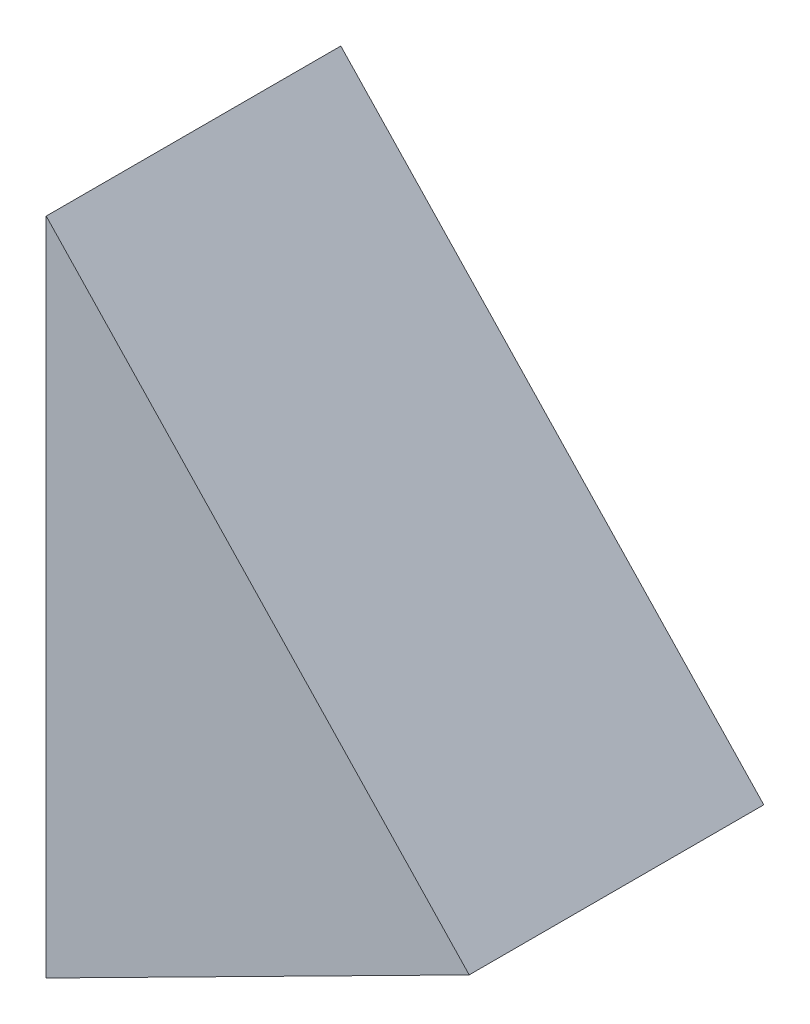
ISO-10303-21;
HEADER;
FILE_DESCRIPTION(('STEP AP214'),'2;1');
FILE_NAME('part.step','',(''),(''),'','','');
FILE_SCHEMA(('AUTOMOTIVE_DESIGN { 1 0 10303 214 1 1 1 1 }'));
ENDSEC;
DATA;
#1=APPLICATION_CONTEXT('core data for automotive mechanical design processes');
#2=APPLICATION_PROTOCOL_DEFINITION('international standard','automotive_design',2000,#1);
#3=PRODUCT_CONTEXT('',#1,'mechanical');
#4=PRODUCT('Part','Part','',(#3));
#5=PRODUCT_RELATED_PRODUCT_CATEGORY('part','',(#4));
#6=PRODUCT_DEFINITION_FORMATION('','',#4);
#7=PRODUCT_DEFINITION_CONTEXT('part definition',#1,'design');
#8=PRODUCT_DEFINITION('design','',#6,#7);
#9=PRODUCT_DEFINITION_SHAPE('','',#8);
#10=(LENGTH_UNIT() NAMED_UNIT(*) SI_UNIT(.MILLI.,.METRE.));
#11=(NAMED_UNIT(*) PLANE_ANGLE_UNIT() SI_UNIT($,.RADIAN.));
#12=(NAMED_UNIT(*) SI_UNIT($,.STERADIAN.) SOLID_ANGLE_UNIT());
#13=UNCERTAINTY_MEASURE_WITH_UNIT(LENGTH_MEASURE(1.E-05),#10,'distance_accuracy_value','');
#14=(GEOMETRIC_REPRESENTATION_CONTEXT(3) GLOBAL_UNCERTAINTY_ASSIGNED_CONTEXT((#13)) GLOBAL_UNIT_ASSIGNED_CONTEXT((#10,
#11,#12)) REPRESENTATION_CONTEXT('',''));
#15=CARTESIAN_POINT('',(0.,0.,0.));
#16=DIRECTION('',(0.,0.,1.));
#17=DIRECTION('',(1.,0.,0.));
#18=AXIS2_PLACEMENT_3D('',#15,#16,#17);
#19=CARTESIAN_POINT('',(7.76554446702481,-4.0125585140577,10.));
#20=DIRECTION('',(-0.451752397755543,0.892143357943171,0.));
#21=DIRECTION('',(-0.892143357943171,-0.451752397755543,0.));
#22=AXIS2_PLACEMENT_3D('',#19,#20,#21);
#23=PLANE('',#22);
#24=DIRECTION('',(0.892143357943171,0.451752397755543,0.));
#25=VECTOR('',#24,1.);
#26=CARTESIAN_POINT('',(7.76554446702481,-4.0125585140577,0.));
#27=LINE('',#26,#25);
#28=CARTESIAN_POINT('',(-3.,-9.46388030311951,0.));
#29=VERTEX_POINT('',#28);
#30=CARTESIAN_POINT('',(11.3593942460264,-2.19274980239476,0.));
#31=VERTEX_POINT('',#30);
#32=EDGE_CURVE('E115',#29,#31,#27,.T.);
#33=ORIENTED_EDGE('',*,*,#32,.T.);
#34=DIRECTION('',(0.,0.,-1.));
#35=VECTOR('',#34,1.);
#36=CARTESIAN_POINT('',(11.3593942460264,-2.19274980239476,10.));
#37=LINE('',#36,#35);
#38=CARTESIAN_POINT('',(11.3593942460264,-2.19274980239476,10.));
#39=VERTEX_POINT('',#38);
#40=EDGE_CURVE('E11',#39,#31,#37,.T.);
#41=ORIENTED_EDGE('',*,*,#40,.F.);
#42=DIRECTION('',(0.892143357943171,0.451752397755543,0.));
#43=VECTOR('',#42,1.);
#44=CARTESIAN_POINT('',(7.76554446702481,-4.0125585140577,10.));
#45=LINE('',#44,#43);
#46=CARTESIAN_POINT('',(-3.,-9.46388030311951,10.));
#47=VERTEX_POINT('',#46);
#48=EDGE_CURVE('E123',#47,#39,#45,.T.);
#49=ORIENTED_EDGE('',*,*,#48,.F.);
#50=DIRECTION('',(0.,0.,-1.));
#51=VECTOR('',#50,1.);
#52=CARTESIAN_POINT('',(-3.,-9.46388030311951,10.));
#53=LINE('',#52,#51);
#54=EDGE_CURVE('E126',#47,#29,#53,.T.);
#55=ORIENTED_EDGE('',*,*,#54,.T.);
#56=EDGE_LOOP('',(#33,#41,#49,#55));
#57=FACE_BOUND('',#56,.T.);
#58=ADVANCED_FACE('F34',(#57),#23,.F.);
#59=CARTESIAN_POINT('',(2.17597130011555,7.48313414050575,10.));
#60=DIRECTION('',(-0.725323766705183,-0.688407897581518,0.));
#61=DIRECTION('',(0.688407897581518,-0.725323766705183,0.));
#62=AXIS2_PLACEMENT_3D('',#59,#60,#61);
#63=PLANE('',#62);
#64=DIRECTION('',(-0.688407897581518,0.725323766705183,0.));
#65=VECTOR('',#64,1.);
#66=CARTESIAN_POINT('',(2.17597130011555,7.48313414050575,0.));
#67=LINE('',#66,#65);
#68=CARTESIAN_POINT('',(-3.,12.9366668686267,0.));
#69=VERTEX_POINT('',#68);
#70=EDGE_CURVE('E63',#31,#69,#67,.T.);
#71=ORIENTED_EDGE('',*,*,#70,.T.);
#72=DIRECTION('',(0.,0.,-1.));
#73=VECTOR('',#72,1.);
#74=CARTESIAN_POINT('',(-3.,12.9366668686267,10.));
#75=LINE('',#74,#73);
#76=CARTESIAN_POINT('',(-3.,12.9366668686267,10.));
#77=VERTEX_POINT('',#76);
#78=EDGE_CURVE('E42',#77,#69,#75,.T.);
#79=ORIENTED_EDGE('',*,*,#78,.F.);
#80=DIRECTION('',(-0.688407897581518,0.725323766705183,0.));
#81=VECTOR('',#80,1.);
#82=CARTESIAN_POINT('',(2.17597130011555,7.48313414050575,10.));
#83=LINE('',#82,#81);
#84=EDGE_CURVE('E71',#39,#77,#83,.T.);
#85=ORIENTED_EDGE('',*,*,#84,.F.);
#86=ORIENTED_EDGE('',*,*,#40,.T.);
#87=EDGE_LOOP('',(#71,#79,#85,#86));
#88=FACE_BOUND('',#87,.T.);
#89=ADVANCED_FACE('F145',(#88),#63,.F.);
#90=CARTESIAN_POINT('',(-3.,-4.58208955223881,10.));
#91=DIRECTION('',(1.,0.,0.));
#92=DIRECTION('',(0.,0.,-1.));
#93=AXIS2_PLACEMENT_3D('',#90,#91,#92);
#94=PLANE('',#93);
#95=DIRECTION('',(0.,-1.,0.));
#96=VECTOR('',#95,1.);
#97=CARTESIAN_POINT('',(-3.,-4.58208955223881,0.));
#98=LINE('',#97,#96);
#99=EDGE_CURVE('E68',#69,#29,#98,.T.);
#100=ORIENTED_EDGE('',*,*,#99,.T.);
#101=ORIENTED_EDGE('',*,*,#54,.F.);
#102=DIRECTION('',(0.,-1.,0.));
#103=VECTOR('',#102,1.);
#104=CARTESIAN_POINT('',(-3.,-4.58208955223881,10.));
#105=LINE('',#104,#103);
#106=EDGE_CURVE('E50',#77,#47,#105,.T.);
#107=ORIENTED_EDGE('',*,*,#106,.F.);
#108=ORIENTED_EDGE('',*,*,#78,.T.);
#109=EDGE_LOOP('',(#100,#101,#107,#108));
#110=FACE_BOUND('',#109,.T.);
#111=ADVANCED_FACE('F130',(#110),#94,.F.);
#112=CARTESIAN_POINT('',(0.,0.,10.));
#113=DIRECTION('',(0.,0.,1.));
#114=DIRECTION('',(1.,0.,0.));
#115=AXIS2_PLACEMENT_3D('',#112,#113,#114);
#116=PLANE('',#115);
#117=ORIENTED_EDGE('',*,*,#48,.T.);
#118=ORIENTED_EDGE('',*,*,#84,.T.);
#119=ORIENTED_EDGE('',*,*,#106,.T.);
#120=EDGE_LOOP('',(#117,#118,#119));
#121=FACE_BOUND('',#120,.T.);
#122=ADVANCED_FACE('F137',(#121),#116,.T.);
#123=CARTESIAN_POINT('',(0.,0.,0.));
#124=DIRECTION('',(0.,0.,1.));
#125=DIRECTION('',(1.,0.,0.));
#126=AXIS2_PLACEMENT_3D('',#123,#124,#125);
#127=PLANE('',#126);
#128=ORIENTED_EDGE('',*,*,#32,.F.);
#129=ORIENTED_EDGE('',*,*,#99,.F.);
#130=ORIENTED_EDGE('',*,*,#70,.F.);
#131=EDGE_LOOP('',(#128,#129,#130));
#132=FACE_BOUND('',#131,.T.);
#133=ADVANCED_FACE('F133',(#132),#127,.F.);
#134=CLOSED_SHELL('',(#58,#89,#111,#122,#133));
#135=CARTESIAN_POINT('',(6.41028727375818,-1.33612844022819,8.));
#136=DIRECTION('',(-0.451752397755543,0.892143357943171,0.));
#137=DIRECTION('',(-0.892143357943171,-0.451752397755543,0.));
#138=AXIS2_PLACEMENT_3D('',#135,#136,#137);
#139=PLANE('',#138);
#140=DIRECTION('',(0.892143357943171,0.451752397755543,0.));
#141=VECTOR('',#140,1.);
#142=CARTESIAN_POINT('',(6.41028727375818,-1.33612844022819,2.));
#143=LINE('',#142,#141);
#144=CARTESIAN_POINT('',(0.,-4.58208955223881,2.));
#145=VERTEX_POINT('',#144);
#146=CARTESIAN_POINT('',(6.41028727375818,-1.33612844022819,2.));
#147=VERTEX_POINT('',#146);
#148=EDGE_CURVE('E217',#145,#147,#143,.T.);
#149=ORIENTED_EDGE('',*,*,#148,.F.);
#150=DIRECTION('',(0.,0.,-1.));
#151=VECTOR('',#150,1.);
#152=CARTESIAN_POINT('',(0.,-4.58208955223881,8.));
#153=LINE('',#152,#151);
#154=CARTESIAN_POINT('',(0.,-4.58208955223881,8.));
#155=VERTEX_POINT('',#154);
#156=EDGE_CURVE('E110',#155,#145,#153,.T.);
#157=ORIENTED_EDGE('',*,*,#156,.F.);
#158=DIRECTION('',(0.892143357943171,0.451752397755543,0.));
#159=VECTOR('',#158,1.);
#160=CARTESIAN_POINT('',(6.41028727375818,-1.33612844022819,8.));
#161=LINE('',#160,#159);
#162=CARTESIAN_POINT('',(6.41028727375818,-1.33612844022819,8.));
#163=VERTEX_POINT('',#162);
#164=EDGE_CURVE('E95',#155,#163,#161,.T.);
#165=ORIENTED_EDGE('',*,*,#164,.T.);
#166=DIRECTION('',(0.,0.,-1.));
#167=VECTOR('',#166,1.);
#168=CARTESIAN_POINT('',(6.41028727375818,-1.33612844022819,8.));
#169=LINE('',#168,#167);
#170=EDGE_CURVE('E107',#163,#147,#169,.T.);
#171=ORIENTED_EDGE('',*,*,#170,.T.);
#172=EDGE_LOOP('',(#149,#157,#165,#171));
#173=FACE_BOUND('',#172,.T.);
#174=ADVANCED_FACE('F106',(#173),#139,.T.);
#175=CARTESIAN_POINT('',(0.,5.41791044776119,8.));
#176=DIRECTION('',(-0.725323766705183,-0.688407897581517,0.));
#177=DIRECTION('',(0.688407897581518,-0.725323766705183,0.));
#178=AXIS2_PLACEMENT_3D('',#175,#176,#177);
#179=PLANE('',#178);
#180=DIRECTION('',(-0.688407897581518,0.725323766705183,0.));
#181=VECTOR('',#180,1.);
#182=CARTESIAN_POINT('',(0.,5.41791044776119,2.));
#183=LINE('',#182,#181);
#184=CARTESIAN_POINT('',(0.,5.41791044776119,2.));
#185=VERTEX_POINT('',#184);
#186=EDGE_CURVE('E114',#147,#185,#183,.T.);
#187=ORIENTED_EDGE('',*,*,#186,.F.);
#188=ORIENTED_EDGE('',*,*,#170,.F.);
#189=DIRECTION('',(-0.688407897581518,0.725323766705183,0.));
#190=VECTOR('',#189,1.);
#191=CARTESIAN_POINT('',(0.,5.41791044776119,8.));
#192=LINE('',#191,#190);
#193=CARTESIAN_POINT('',(0.,5.41791044776119,8.));
#194=VERTEX_POINT('',#193);
#195=EDGE_CURVE('E92',#163,#194,#192,.T.);
#196=ORIENTED_EDGE('',*,*,#195,.T.);
#197=DIRECTION('',(0.,0.,-1.));
#198=VECTOR('',#197,1.);
#199=CARTESIAN_POINT('',(0.,5.41791044776119,8.));
#200=LINE('',#199,#198);
#201=EDGE_CURVE('E116',#194,#185,#200,.T.);
#202=ORIENTED_EDGE('',*,*,#201,.T.);
#203=EDGE_LOOP('',(#187,#188,#196,#202));
#204=FACE_BOUND('',#203,.T.);
#205=ADVANCED_FACE('F113',(#204),#179,.T.);
#206=CARTESIAN_POINT('',(0.,-4.58208955223881,8.));
#207=DIRECTION('',(1.,0.,0.));
#208=DIRECTION('',(0.,0.,-1.));
#209=AXIS2_PLACEMENT_3D('',#206,#207,#208);
#210=PLANE('',#209);
#211=DIRECTION('',(0.,-1.,0.));
#212=VECTOR('',#211,1.);
#213=CARTESIAN_POINT('',(0.,-4.58208955223881,2.));
#214=LINE('',#213,#212);
#215=EDGE_CURVE('E111',#185,#145,#214,.T.);
#216=ORIENTED_EDGE('',*,*,#215,.F.);
#217=ORIENTED_EDGE('',*,*,#201,.F.);
#218=DIRECTION('',(0.,-1.,0.));
#219=VECTOR('',#218,1.);
#220=CARTESIAN_POINT('',(0.,-4.58208955223881,8.));
#221=LINE('',#220,#219);
#222=EDGE_CURVE('E96',#194,#155,#221,.T.);
#223=ORIENTED_EDGE('',*,*,#222,.T.);
#224=ORIENTED_EDGE('',*,*,#156,.T.);
#225=EDGE_LOOP('',(#216,#217,#223,#224));
#226=FACE_BOUND('',#225,.T.);
#227=ADVANCED_FACE('F185',(#226),#210,.T.);
#228=CARTESIAN_POINT('',(0.,0.,8.));
#229=DIRECTION('',(0.,0.,1.));
#230=DIRECTION('',(1.,0.,0.));
#231=AXIS2_PLACEMENT_3D('',#228,#229,#230);
#232=PLANE('',#231);
#233=ORIENTED_EDGE('',*,*,#164,.F.);
#234=ORIENTED_EDGE('',*,*,#222,.F.);
#235=ORIENTED_EDGE('',*,*,#195,.F.);
#236=EDGE_LOOP('',(#233,#234,#235));
#237=FACE_BOUND('',#236,.T.);
#238=ADVANCED_FACE('F94',(#237),#232,.F.);
#239=CARTESIAN_POINT('',(0.,0.,2.));
#240=DIRECTION('',(0.,0.,1.));
#241=DIRECTION('',(1.,0.,0.));
#242=AXIS2_PLACEMENT_3D('',#239,#240,#241);
#243=PLANE('',#242);
#244=ORIENTED_EDGE('',*,*,#148,.T.);
#245=ORIENTED_EDGE('',*,*,#186,.T.);
#246=ORIENTED_EDGE('',*,*,#215,.T.);
#247=EDGE_LOOP('',(#244,#245,#246));
#248=FACE_BOUND('',#247,.T.);
#249=ADVANCED_FACE('F203',(#248),#243,.T.);
#250=CLOSED_SHELL('',(#174,#205,#227,#238,#249));
#251=ORIENTED_CLOSED_SHELL('',*,#250,.T.);
#252=BREP_WITH_VOIDS('B2',#134,(#251));
#253=ADVANCED_BREP_SHAPE_REPRESENTATION('',(#18,#252),#14);
#254=SHAPE_DEFINITION_REPRESENTATION(#9,#253);
ENDSEC;
END-ISO-10303-21;
